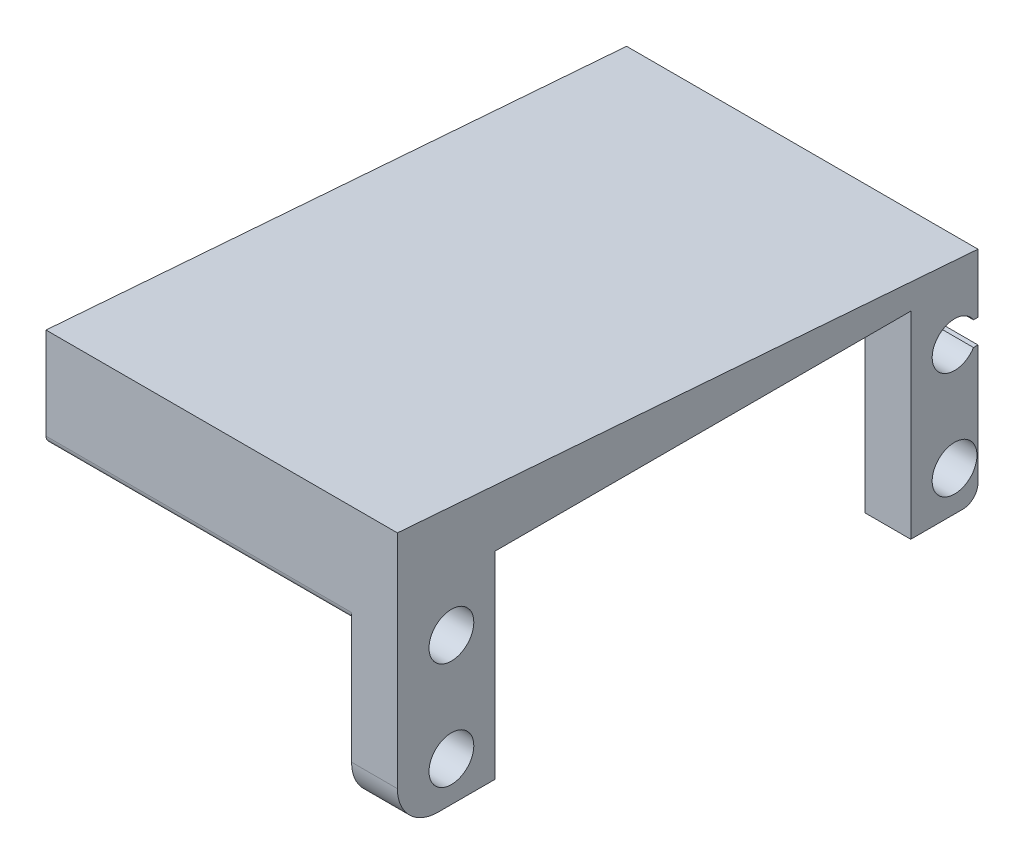
ISO-10303-21;
HEADER;
FILE_DESCRIPTION(('STEP AP214'),'2;1');
FILE_NAME('part.step','',(''),(''),'','','');
FILE_SCHEMA(('AUTOMOTIVE_DESIGN { 1 0 10303 214 1 1 1 1 }'));
ENDSEC;
DATA;
#1=APPLICATION_CONTEXT('core data for automotive mechanical design processes');
#2=APPLICATION_PROTOCOL_DEFINITION('international standard','automotive_design',2000,#1);
#3=PRODUCT_CONTEXT('',#1,'mechanical');
#4=PRODUCT('Part','Part','',(#3));
#5=PRODUCT_RELATED_PRODUCT_CATEGORY('part','',(#4));
#6=PRODUCT_DEFINITION_FORMATION('','',#4);
#7=PRODUCT_DEFINITION_CONTEXT('part definition',#1,'design');
#8=PRODUCT_DEFINITION('design','',#6,#7);
#9=PRODUCT_DEFINITION_SHAPE('','',#8);
#10=(LENGTH_UNIT() NAMED_UNIT(*) SI_UNIT(.MILLI.,.METRE.));
#11=(NAMED_UNIT(*) PLANE_ANGLE_UNIT() SI_UNIT($,.RADIAN.));
#12=(NAMED_UNIT(*) SI_UNIT($,.STERADIAN.) SOLID_ANGLE_UNIT());
#13=UNCERTAINTY_MEASURE_WITH_UNIT(LENGTH_MEASURE(1.E-05),#10,'distance_accuracy_value','');
#14=(GEOMETRIC_REPRESENTATION_CONTEXT(3) GLOBAL_UNCERTAINTY_ASSIGNED_CONTEXT((#13)) GLOBAL_UNIT_ASSIGNED_CONTEXT((#10,
#11,#12)) REPRESENTATION_CONTEXT('',''));
#15=CARTESIAN_POINT('',(0.,0.,0.));
#16=DIRECTION('',(0.,0.,1.));
#17=DIRECTION('',(1.,0.,0.));
#18=AXIS2_PLACEMENT_3D('',#15,#16,#17);
#19=CARTESIAN_POINT('',(-110.040337845467,7.82498196403375E-13,-1.90929559922423E-12));
#20=DIRECTION('',(1.,0.,0.));
#21=DIRECTION('',(0.,0.,-1.));
#22=AXIS2_PLACEMENT_3D('',#19,#20,#21);
#23=PLANE('',#22);
#24=CARTESIAN_POINT('',(-110.040337845464,42.7317666313925,-168.091431391015));
#25=DIRECTION('',(1.,0.,0.));
#26=DIRECTION('',(0.,0.,-1.));
#27=AXIS2_PLACEMENT_3D('',#24,#25,#26);
#28=CIRCLE('',#27,2.19999999999998);
#29=CARTESIAN_POINT('',(-110.040337845464,42.7317666313925,-170.291431391015));
#30=VERTEX_POINT('',#29);
#31=EDGE_CURVE('E210',#30,#30,#28,.T.);
#32=ORIENTED_EDGE('',*,*,#31,.T.);
#33=EDGE_LOOP('',(#32));
#34=FACE_BOUND('',#33,.T.);
#35=CARTESIAN_POINT('',(-110.040337845464,53.2317666313925,-168.091431391015));
#36=DIRECTION('',(1.,0.,0.));
#37=DIRECTION('',(0.,0.,-1.));
#38=AXIS2_PLACEMENT_3D('',#35,#36,#37);
#39=CIRCLE('',#38,2.19999999999998);
#40=CARTESIAN_POINT('',(-110.040337845464,53.2317666313925,-170.291431391015));
#41=VERTEX_POINT('',#40);
#42=EDGE_CURVE('E207',#41,#41,#39,.T.);
#43=ORIENTED_EDGE('',*,*,#42,.T.);
#44=EDGE_LOOP('',(#43));
#45=FACE_BOUND('',#44,.T.);
#46=DIRECTION('',(0.,-1.,0.));
#47=VECTOR('',#46,1.);
#48=CARTESIAN_POINT('',(-110.040337845465,5.74715523288253E-13,-162.791431391015));
#49=LINE('',#48,#47);
#50=CARTESIAN_POINT('',(-110.040337845464,55.5574598733274,-162.791431391015));
#51=VERTEX_POINT('',#50);
#52=CARTESIAN_POINT('',(-110.040337845464,42.8317666313926,-162.791431391015));
#53=VERTEX_POINT('',#52);
#54=EDGE_CURVE('E180',#51,#53,#49,.T.);
#55=ORIENTED_EDGE('',*,*,#54,.F.);
#56=CARTESIAN_POINT('',(-110.040337845464,55.5574598733274,-163.541431391015));
#57=DIRECTION('',(1.,0.,0.));
#58=DIRECTION('',(0.,0.,-1.));
#59=AXIS2_PLACEMENT_3D('',#56,#57,#58);
#60=CIRCLE('',#59,0.750000000000012);
#61=CARTESIAN_POINT('',(-110.040337845464,54.8074598733274,-163.541431391015));
#62=VERTEX_POINT('',#61);
#63=EDGE_CURVE('E312',#51,#62,#60,.T.);
#64=ORIENTED_EDGE('',*,*,#63,.T.);
#65=DIRECTION('',(0.,0.,1.));
#66=VECTOR('',#65,1.);
#67=CARTESIAN_POINT('',(-110.040337845467,54.8074598733274,-1.90929559922423E-12));
#68=LINE('',#67,#66);
#69=CARTESIAN_POINT('',(-110.040337845464,54.8074598733274,-165.491431391015));
#70=VERTEX_POINT('',#69);
#71=EDGE_CURVE('E352',#70,#62,#68,.T.);
#72=ORIENTED_EDGE('',*,*,#71,.F.);
#73=DIRECTION('',(0.,-1.,0.));
#74=VECTOR('',#73,1.);
#75=CARTESIAN_POINT('',(-110.040337845465,7.8249819640336E-13,-165.491431391015));
#76=LINE('',#75,#74);
#77=CARTESIAN_POINT('',(-110.040337845464,57.4317666313925,-165.491431391015));
#78=VERTEX_POINT('',#77);
#79=EDGE_CURVE('E355',#78,#70,#76,.T.);
#80=ORIENTED_EDGE('',*,*,#79,.F.);
#81=DIRECTION('',(0.,0.,1.));
#82=VECTOR('',#81,1.);
#83=CARTESIAN_POINT('',(-110.040337845467,57.4317666313925,-1.90929559922423E-12));
#84=LINE('',#83,#82);
#85=CARTESIAN_POINT('',(-110.040337845464,57.4317666313925,-172.391431391015));
#86=VERTEX_POINT('',#85);
#87=EDGE_CURVE('E256',#86,#78,#84,.T.);
#88=ORIENTED_EDGE('',*,*,#87,.F.);
#89=DIRECTION('',(0.,1.,0.));
#90=VECTOR('',#89,1.);
#91=CARTESIAN_POINT('',(-110.040337845464,7.82498196403354E-13,-172.391431391015));
#92=LINE('',#91,#90);
#93=CARTESIAN_POINT('',(-110.040337845464,38.8317666313925,-172.391431391015));
#94=VERTEX_POINT('',#93);
#95=EDGE_CURVE('E186',#94,#86,#92,.T.);
#96=ORIENTED_EDGE('',*,*,#95,.F.);
#97=DIRECTION('',(0.,0.,-1.));
#98=VECTOR('',#97,1.);
#99=CARTESIAN_POINT('',(-110.040337845467,38.8317666313927,-1.95741158293075E-12));
#100=LINE('',#99,#98);
#101=CARTESIAN_POINT('',(-110.040337845464,38.8317666313925,-166.791431391015));
#102=VERTEX_POINT('',#101);
#103=EDGE_CURVE('E184',#102,#94,#100,.T.);
#104=ORIENTED_EDGE('',*,*,#103,.F.);
#105=CARTESIAN_POINT('',(-110.040337845464,42.8317666313925,-166.791431391015));
#106=DIRECTION('',(1.,0.,0.));
#107=DIRECTION('',(0.,0.,-1.));
#108=AXIS2_PLACEMENT_3D('',#105,#106,#107);
#109=CIRCLE('',#108,4.);
#110=EDGE_CURVE('E182',#53,#102,#109,.T.);
#111=ORIENTED_EDGE('',*,*,#110,.F.);
#112=EDGE_LOOP('',(#55,#64,#72,#80,#88,#96,#104,#111));
#113=FACE_BOUND('',#112,.T.);
#114=ADVANCED_FACE('F39',(#34,#45,#113),#23,.F.);
#115=CARTESIAN_POINT('',(-105.540337845465,5.43292191238663E-13,-162.791431391015));
#116=DIRECTION('',(0.,0.,-1.));
#117=DIRECTION('',(-1.,0.,0.));
#118=AXIS2_PLACEMENT_3D('',#115,#116,#117);
#119=PLANE('',#118);
#120=DIRECTION('',(-1.,0.,0.));
#121=VECTOR('',#120,1.);
#122=CARTESIAN_POINT('',(-105.540337845464,64.5774195090353,-162.791431391015));
#123=LINE('',#122,#121);
#124=CARTESIAN_POINT('',(-105.540337845464,64.5774195090353,-162.791431391015));
#125=VERTEX_POINT('',#124);
#126=CARTESIAN_POINT('',(-140.040337845464,64.5774195090356,-162.791431391015));
#127=VERTEX_POINT('',#126);
#128=EDGE_CURVE('E179',#125,#127,#123,.T.);
#129=ORIENTED_EDGE('',*,*,#128,.T.);
#130=DIRECTION('',(0.,-1.,0.));
#131=VECTOR('',#130,1.);
#132=CARTESIAN_POINT('',(-140.040337845465,7.84204403618855E-13,-162.791431391015));
#133=LINE('',#132,#131);
#134=CARTESIAN_POINT('',(-140.040337845464,55.5574598733276,-162.791431391015));
#135=VERTEX_POINT('',#134);
#136=EDGE_CURVE('E322',#127,#135,#133,.T.);
#137=ORIENTED_EDGE('',*,*,#136,.T.);
#138=DIRECTION('',(1.,0.,0.));
#139=VECTOR('',#138,1.);
#140=CARTESIAN_POINT('',(-140.040337845464,55.5574598733276,-162.791431391015));
#141=LINE('',#140,#139);
#142=EDGE_CURVE('E307',#135,#51,#141,.T.);
#143=ORIENTED_EDGE('',*,*,#142,.T.);
#144=ORIENTED_EDGE('',*,*,#54,.T.);
#145=DIRECTION('',(-1.,0.,0.));
#146=VECTOR('',#145,1.);
#147=CARTESIAN_POINT('',(-105.540337845464,42.8317666313925,-162.791431391015));
#148=LINE('',#147,#146);
#149=CARTESIAN_POINT('',(-105.540337845464,42.8317666313925,-162.791431391015));
#150=VERTEX_POINT('',#149);
#151=EDGE_CURVE('E11',#150,#53,#148,.T.);
#152=ORIENTED_EDGE('',*,*,#151,.F.);
#153=DIRECTION('',(0.,-1.,0.));
#154=VECTOR('',#153,1.);
#155=CARTESIAN_POINT('',(-105.540337845465,5.43292191238663E-13,-162.791431391015));
#156=LINE('',#155,#154);
#157=EDGE_CURVE('E213',#125,#150,#156,.T.);
#158=ORIENTED_EDGE('',*,*,#157,.F.);
#159=EDGE_LOOP('',(#129,#137,#143,#144,#152,#158));
#160=FACE_BOUND('',#159,.T.);
#161=ADVANCED_FACE('F41',(#160),#119,.F.);
#162=CARTESIAN_POINT('',(-105.540337845464,42.8317666313925,-166.791431391015));
#163=DIRECTION('',(-1.,0.,0.));
#164=DIRECTION('',(0.,0.,1.));
#165=AXIS2_PLACEMENT_3D('',#162,#163,#164);
#166=CYLINDRICAL_SURFACE('',#165,4.);
#167=ORIENTED_EDGE('',*,*,#110,.T.);
#168=DIRECTION('',(-1.,0.,0.));
#169=VECTOR('',#168,1.);
#170=CARTESIAN_POINT('',(-105.540337845464,38.8317666313925,-166.791431391015));
#171=LINE('',#170,#169);
#172=CARTESIAN_POINT('',(-105.540337845464,38.8317666313925,-166.791431391015));
#173=VERTEX_POINT('',#172);
#174=EDGE_CURVE('E47',#173,#102,#171,.T.);
#175=ORIENTED_EDGE('',*,*,#174,.F.);
#176=CARTESIAN_POINT('',(-105.540337845464,42.8317666313925,-166.791431391015));
#177=DIRECTION('',(1.,0.,0.));
#178=DIRECTION('',(0.,0.,-1.));
#179=AXIS2_PLACEMENT_3D('',#176,#177,#178);
#180=CIRCLE('',#179,4.);
#181=EDGE_CURVE('E111',#150,#173,#180,.T.);
#182=ORIENTED_EDGE('',*,*,#181,.F.);
#183=ORIENTED_EDGE('',*,*,#151,.T.);
#184=EDGE_LOOP('',(#167,#175,#182,#183));
#185=FACE_BOUND('',#184,.T.);
#186=ADVANCED_FACE('F424',(#185),#166,.T.);
#187=CARTESIAN_POINT('',(-105.540337845467,38.8317666313927,-1.87885325280678E-12));
#188=DIRECTION('',(0.,1.,0.));
#189=DIRECTION('',(-1.,0.,0.));
#190=AXIS2_PLACEMENT_3D('',#187,#188,#189);
#191=PLANE('',#190);
#192=ORIENTED_EDGE('',*,*,#103,.T.);
#193=DIRECTION('',(-1.,0.,0.));
#194=VECTOR('',#193,1.);
#195=CARTESIAN_POINT('',(-105.540337845464,38.8317666313925,-172.391431391015));
#196=LINE('',#195,#194);
#197=CARTESIAN_POINT('',(-105.540337845464,38.8317666313925,-172.391431391015));
#198=VERTEX_POINT('',#197);
#199=EDGE_CURVE('E239',#198,#94,#196,.T.);
#200=ORIENTED_EDGE('',*,*,#199,.F.);
#201=DIRECTION('',(0.,0.,-1.));
#202=VECTOR('',#201,1.);
#203=CARTESIAN_POINT('',(-105.540337845467,38.8317666313927,-1.87885325280678E-12));
#204=LINE('',#203,#202);
#205=EDGE_CURVE('E247',#173,#198,#204,.T.);
#206=ORIENTED_EDGE('',*,*,#205,.F.);
#207=ORIENTED_EDGE('',*,*,#174,.T.);
#208=EDGE_LOOP('',(#192,#200,#206,#207));
#209=FACE_BOUND('',#208,.T.);
#210=ADVANCED_FACE('F245',(#209),#191,.F.);
#211=CARTESIAN_POINT('',(-105.540337845464,7.51074864353763E-13,-172.391431391015));
#212=DIRECTION('',(0.,0.,1.));
#213=DIRECTION('',(1.,0.,0.));
#214=AXIS2_PLACEMENT_3D('',#211,#212,#213);
#215=PLANE('',#214);
#216=ORIENTED_EDGE('',*,*,#95,.T.);
#217=DIRECTION('',(1.,0.,0.));
#218=VECTOR('',#217,1.);
#219=CARTESIAN_POINT('',(-140.040337845464,57.4317666313927,-172.391431391015));
#220=LINE('',#219,#218);
#221=CARTESIAN_POINT('',(-140.040337845464,57.4317666313927,-172.391431391015));
#222=VERTEX_POINT('',#221);
#223=EDGE_CURVE('E263',#222,#86,#220,.T.);
#224=ORIENTED_EDGE('',*,*,#223,.F.);
#225=DIRECTION('',(0.,1.,0.));
#226=VECTOR('',#225,1.);
#227=CARTESIAN_POINT('',(-140.040337845464,9.91987076733955E-13,-172.391431391015));
#228=LINE('',#227,#226);
#229=CARTESIAN_POINT('',(-140.040337845464,58.2317666313928,-172.391431391015));
#230=VERTEX_POINT('',#229);
#231=EDGE_CURVE('E338',#222,#230,#228,.T.);
#232=ORIENTED_EDGE('',*,*,#231,.T.);
#233=DIRECTION('',(-1.,0.,0.));
#234=VECTOR('',#233,1.);
#235=CARTESIAN_POINT('',(-105.540337845464,58.2317666313925,-172.391431391015));
#236=LINE('',#235,#234);
#237=CARTESIAN_POINT('',(-105.540337845464,58.2317666313925,-172.391431391015));
#238=VERTEX_POINT('',#237);
#239=EDGE_CURVE('E236',#238,#230,#236,.T.);
#240=ORIENTED_EDGE('',*,*,#239,.F.);
#241=DIRECTION('',(0.,1.,0.));
#242=VECTOR('',#241,1.);
#243=CARTESIAN_POINT('',(-105.540337845464,7.51074864353763E-13,-172.391431391015));
#244=LINE('',#243,#242);
#245=EDGE_CURVE('E372',#198,#238,#244,.T.);
#246=ORIENTED_EDGE('',*,*,#245,.F.);
#247=ORIENTED_EDGE('',*,*,#199,.T.);
#248=EDGE_LOOP('',(#216,#224,#232,#240,#246,#247));
#249=FACE_BOUND('',#248,.T.);
#250=ADVANCED_FACE('F259',(#249),#215,.F.);
#251=CARTESIAN_POINT('',(-105.540337845467,58.2317666313925,-1.82083373845094E-12));
#252=DIRECTION('',(0.,1.,0.));
#253=DIRECTION('',(-1.,0.,0.));
#254=AXIS2_PLACEMENT_3D('',#251,#252,#253);
#255=PLANE('',#254);
#256=ORIENTED_EDGE('',*,*,#239,.T.);
#257=DIRECTION('',(0.,0.,-1.));
#258=VECTOR('',#257,1.);
#259=CARTESIAN_POINT('',(-140.040337845467,58.2317666313927,-2.42311426940138E-12));
#260=LINE('',#259,#258);
#261=CARTESIAN_POINT('',(-140.040337845463,58.2317666313928,-213.191431391015));
#262=VERTEX_POINT('',#261);
#263=EDGE_CURVE('E340',#230,#262,#260,.T.);
#264=ORIENTED_EDGE('',*,*,#263,.T.);
#265=DIRECTION('',(-1.,0.,0.));
#266=VECTOR('',#265,1.);
#267=CARTESIAN_POINT('',(-105.540337845463,58.2317666313925,-213.191431391015));
#268=LINE('',#267,#266);
#269=CARTESIAN_POINT('',(-105.540337845463,58.2317666313925,-213.191431391015));
#270=VERTEX_POINT('',#269);
#271=EDGE_CURVE('E233',#270,#262,#268,.T.);
#272=ORIENTED_EDGE('',*,*,#271,.F.);
#273=DIRECTION('',(0.,0.,-1.));
#274=VECTOR('',#273,1.);
#275=CARTESIAN_POINT('',(-105.540337845467,58.2317666313925,-1.82083373845094E-12));
#276=LINE('',#275,#274);
#277=EDGE_CURVE('E374',#238,#270,#276,.T.);
#278=ORIENTED_EDGE('',*,*,#277,.F.);
#279=EDGE_LOOP('',(#256,#264,#272,#278));
#280=FACE_BOUND('',#279,.T.);
#281=ADVANCED_FACE('F411',(#280),#255,.F.);
#282=CARTESIAN_POINT('',(-105.540337845464,7.51074864353761E-13,-213.191431391015));
#283=DIRECTION('',(0.,0.,-1.));
#284=DIRECTION('',(-1.,0.,0.));
#285=AXIS2_PLACEMENT_3D('',#282,#283,#284);
#286=PLANE('',#285);
#287=ORIENTED_EDGE('',*,*,#271,.T.);
#288=DIRECTION('',(0.,-1.,0.));
#289=VECTOR('',#288,1.);
#290=CARTESIAN_POINT('',(-140.040337845464,9.91987076733953E-13,-213.191431391015));
#291=LINE('',#290,#289);
#292=CARTESIAN_POINT('',(-140.040337845463,57.4317666313927,-213.191431391015));
#293=VERTEX_POINT('',#292);
#294=EDGE_CURVE('E343',#262,#293,#291,.T.);
#295=ORIENTED_EDGE('',*,*,#294,.T.);
#296=DIRECTION('',(1.,0.,0.));
#297=VECTOR('',#296,1.);
#298=CARTESIAN_POINT('',(-140.040337845463,57.4317666313927,-213.191431391015));
#299=LINE('',#298,#297);
#300=CARTESIAN_POINT('',(-110.040337845463,57.4317666313925,-213.191431391015));
#301=VERTEX_POINT('',#300);
#302=EDGE_CURVE('E359',#293,#301,#299,.T.);
#303=ORIENTED_EDGE('',*,*,#302,.T.);
#304=DIRECTION('',(0.,-1.,0.));
#305=VECTOR('',#304,1.);
#306=CARTESIAN_POINT('',(-110.040337845464,7.82498196403351E-13,-213.191431391015));
#307=LINE('',#306,#305);
#308=CARTESIAN_POINT('',(-110.040337845463,38.8317666313925,-213.191431391015));
#309=VERTEX_POINT('',#308);
#310=EDGE_CURVE('E189',#301,#309,#307,.T.);
#311=ORIENTED_EDGE('',*,*,#310,.T.);
#312=DIRECTION('',(-1.,0.,0.));
#313=VECTOR('',#312,1.);
#314=CARTESIAN_POINT('',(-105.540337845463,38.8317666313925,-213.191431391015));
#315=LINE('',#314,#313);
#316=CARTESIAN_POINT('',(-105.540337845463,38.8317666313925,-213.191431391015));
#317=VERTEX_POINT('',#316);
#318=EDGE_CURVE('E230',#317,#309,#315,.T.);
#319=ORIENTED_EDGE('',*,*,#318,.F.);
#320=DIRECTION('',(0.,-1.,0.));
#321=VECTOR('',#320,1.);
#322=CARTESIAN_POINT('',(-105.540337845464,7.51074864353761E-13,-213.191431391015));
#323=LINE('',#322,#321);
#324=EDGE_CURVE('E376',#270,#317,#323,.T.);
#325=ORIENTED_EDGE('',*,*,#324,.F.);
#326=EDGE_LOOP('',(#287,#295,#303,#311,#319,#325));
#327=FACE_BOUND('',#326,.T.);
#328=ADVANCED_FACE('F404',(#327),#286,.F.);
#329=CARTESIAN_POINT('',(-105.540337845467,38.8317666313925,-1.83073726910026E-12));
#330=DIRECTION('',(0.,1.,0.));
#331=DIRECTION('',(-1.,0.,0.));
#332=AXIS2_PLACEMENT_3D('',#329,#330,#331);
#333=PLANE('',#332);
#334=DIRECTION('',(0.,0.,-1.));
#335=VECTOR('',#334,1.);
#336=CARTESIAN_POINT('',(-110.040337845467,38.8317666313925,-1.90929559922423E-12));
#337=LINE('',#336,#335);
#338=CARTESIAN_POINT('',(-110.040337845463,38.8317666313925,-218.291431391014));
#339=VERTEX_POINT('',#338);
#340=EDGE_CURVE('E191',#309,#339,#337,.T.);
#341=ORIENTED_EDGE('',*,*,#340,.T.);
#342=DIRECTION('',(-1.,0.,0.));
#343=VECTOR('',#342,1.);
#344=CARTESIAN_POINT('',(-105.540337845463,38.8317666313925,-218.291431391014));
#345=LINE('',#344,#343);
#346=CARTESIAN_POINT('',(-105.540337845463,38.8317666313925,-218.291431391014));
#347=VERTEX_POINT('',#346);
#348=EDGE_CURVE('E227',#347,#339,#345,.T.);
#349=ORIENTED_EDGE('',*,*,#348,.F.);
#350=DIRECTION('',(0.,0.,-1.));
#351=VECTOR('',#350,1.);
#352=CARTESIAN_POINT('',(-105.540337845467,38.8317666313925,-1.83073726910026E-12));
#353=LINE('',#352,#351);
#354=EDGE_CURVE('E378',#317,#347,#353,.T.);
#355=ORIENTED_EDGE('',*,*,#354,.F.);
#356=ORIENTED_EDGE('',*,*,#318,.T.);
#357=EDGE_LOOP('',(#341,#349,#355,#356));
#358=FACE_BOUND('',#357,.T.);
#359=ADVANCED_FACE('F523',(#358),#333,.F.);
#360=CARTESIAN_POINT('',(-105.540337845463,40.3317666313925,-218.291431391014));
#361=DIRECTION('',(-1.,0.,0.));
#362=DIRECTION('',(0.,0.,1.));
#363=AXIS2_PLACEMENT_3D('',#360,#361,#362);
#364=CYLINDRICAL_SURFACE('',#363,1.5);
#365=CARTESIAN_POINT('',(-110.040337845463,40.3317666313925,-218.291431391014));
#366=DIRECTION('',(1.,0.,0.));
#367=DIRECTION('',(0.,0.,-1.));
#368=AXIS2_PLACEMENT_3D('',#365,#366,#367);
#369=CIRCLE('',#368,1.5);
#370=CARTESIAN_POINT('',(-110.040337845463,40.3317666313925,-219.791431391014));
#371=VERTEX_POINT('',#370);
#372=EDGE_CURVE('E193',#339,#371,#369,.T.);
#373=ORIENTED_EDGE('',*,*,#372,.T.);
#374=DIRECTION('',(-1.,0.,0.));
#375=VECTOR('',#374,1.);
#376=CARTESIAN_POINT('',(-105.540337845463,40.3317666313925,-219.791431391014));
#377=LINE('',#376,#375);
#378=CARTESIAN_POINT('',(-105.540337845463,40.3317666313925,-219.791431391014));
#379=VERTEX_POINT('',#378);
#380=EDGE_CURVE('E224',#379,#371,#377,.T.);
#381=ORIENTED_EDGE('',*,*,#380,.F.);
#382=CARTESIAN_POINT('',(-105.540337845463,40.3317666313925,-218.291431391014));
#383=DIRECTION('',(1.,0.,0.));
#384=DIRECTION('',(0.,0.,-1.));
#385=AXIS2_PLACEMENT_3D('',#382,#383,#384);
#386=CIRCLE('',#385,1.5);
#387=EDGE_CURVE('E380',#347,#379,#386,.T.);
#388=ORIENTED_EDGE('',*,*,#387,.F.);
#389=ORIENTED_EDGE('',*,*,#348,.T.);
#390=EDGE_LOOP('',(#373,#381,#388,#389));
#391=FACE_BOUND('',#390,.T.);
#392=ADVANCED_FACE('F624',(#391),#364,.T.);
#393=CARTESIAN_POINT('',(-105.540337845464,-8.61606387491849E-12,-219.791431391013));
#394=DIRECTION('',(0.,0.,1.));
#395=DIRECTION('',(0.,-1.,0.));
#396=AXIS2_PLACEMENT_3D('',#393,#394,#395);
#397=PLANE('',#396);
#398=DIRECTION('',(0.,1.,0.));
#399=VECTOR('',#398,1.);
#400=CARTESIAN_POINT('',(-110.040337845464,-8.5846405428689E-12,-219.791431391013));
#401=LINE('',#400,#399);
#402=CARTESIAN_POINT('',(-110.040337845463,52.0567666313906,-219.791431391015));
#403=VERTEX_POINT('',#402);
#404=EDGE_CURVE('E195',#371,#403,#401,.T.);
#405=ORIENTED_EDGE('',*,*,#404,.T.);
#406=DIRECTION('',(-1.,0.,0.));
#407=VECTOR('',#406,1.);
#408=CARTESIAN_POINT('',(-105.540337845463,52.0567666313905,-219.791431391015));
#409=LINE('',#408,#407);
#410=CARTESIAN_POINT('',(-105.540337845463,52.0567666313905,-219.791431391015));
#411=VERTEX_POINT('',#410);
#412=EDGE_CURVE('E221',#411,#403,#409,.T.);
#413=ORIENTED_EDGE('',*,*,#412,.F.);
#414=DIRECTION('',(0.,1.,0.));
#415=VECTOR('',#414,1.);
#416=CARTESIAN_POINT('',(-105.540337845464,-8.61606387491849E-12,-219.791431391013));
#417=LINE('',#416,#415);
#418=EDGE_CURVE('E382',#379,#411,#417,.T.);
#419=ORIENTED_EDGE('',*,*,#418,.F.);
#420=ORIENTED_EDGE('',*,*,#380,.T.);
#421=EDGE_LOOP('',(#405,#413,#419,#420));
#422=FACE_BOUND('',#421,.T.);
#423=ADVANCED_FACE('F614',(#422),#397,.F.);
#424=CARTESIAN_POINT('',(-105.540337845467,52.0567666313998,-4.02404313232045E-12));
#425=DIRECTION('',(0.,-1.,0.));
#426=DIRECTION('',(0.,0.,-1.));
#427=AXIS2_PLACEMENT_3D('',#424,#425,#426);
#428=PLANE('',#427);
#429=DIRECTION('',(0.,0.,1.));
#430=VECTOR('',#429,1.);
#431=CARTESIAN_POINT('',(-110.040337845467,52.0567666313998,-4.10260146244442E-12));
#432=LINE('',#431,#430);
#433=CARTESIAN_POINT('',(-110.040337845463,52.0567666313906,-219.351370906161));
#434=VERTEX_POINT('',#433);
#435=EDGE_CURVE('E197',#403,#434,#432,.T.);
#436=ORIENTED_EDGE('',*,*,#435,.T.);
#437=DIRECTION('',(-1.,0.,0.));
#438=VECTOR('',#437,1.);
#439=CARTESIAN_POINT('',(-105.540337845463,52.0567666313906,-219.351370906161));
#440=LINE('',#439,#438);
#441=CARTESIAN_POINT('',(-105.540337845463,52.0567666313906,-219.351370906161));
#442=VERTEX_POINT('',#441);
#443=EDGE_CURVE('E218',#442,#434,#440,.T.);
#444=ORIENTED_EDGE('',*,*,#443,.F.);
#445=DIRECTION('',(0.,0.,1.));
#446=VECTOR('',#445,1.);
#447=CARTESIAN_POINT('',(-105.540337845467,52.0567666313998,-4.02404313232045E-12));
#448=LINE('',#447,#446);
#449=EDGE_CURVE('E384',#411,#442,#448,.T.);
#450=ORIENTED_EDGE('',*,*,#449,.F.);
#451=ORIENTED_EDGE('',*,*,#412,.T.);
#452=EDGE_LOOP('',(#436,#444,#450,#451));
#453=FACE_BOUND('',#452,.T.);
#454=ADVANCED_FACE('F390',(#453),#428,.F.);
#455=CARTESIAN_POINT('',(-105.540337845463,53.2317666313906,-217.491431391015));
#456=DIRECTION('',(-1.,0.,0.));
#457=DIRECTION('',(0.,0.,1.));
#458=AXIS2_PLACEMENT_3D('',#455,#456,#457);
#459=CYLINDRICAL_SURFACE('',#458,2.2);
#460=CARTESIAN_POINT('',(-110.040337845463,53.2317666313907,-217.491431391016));
#461=DIRECTION('',(1.,0.,0.));
#462=DIRECTION('',(0.,0.,-1.));
#463=AXIS2_PLACEMENT_3D('',#460,#461,#462);
#464=CIRCLE('',#463,2.2);
#465=CARTESIAN_POINT('',(-110.040337845463,54.4067666313906,-219.351370906161));
#466=VERTEX_POINT('',#465);
#467=EDGE_CURVE('E199',#434,#466,#464,.F.);
#468=ORIENTED_EDGE('',*,*,#467,.T.);
#469=DIRECTION('',(-1.,0.,0.));
#470=VECTOR('',#469,1.);
#471=CARTESIAN_POINT('',(-105.540337845463,54.4067666313906,-219.351370906161));
#472=LINE('',#471,#470);
#473=CARTESIAN_POINT('',(-105.540337845463,54.4067666313906,-219.351370906161));
#474=VERTEX_POINT('',#473);
#475=EDGE_CURVE('E160',#474,#466,#472,.T.);
#476=ORIENTED_EDGE('',*,*,#475,.F.);
#477=CARTESIAN_POINT('',(-105.540337845463,53.2317666313906,-217.491431391015));
#478=DIRECTION('',(1.,0.,0.));
#479=DIRECTION('',(0.,0.,-1.));
#480=AXIS2_PLACEMENT_3D('',#477,#478,#479);
#481=CIRCLE('',#480,2.2);
#482=EDGE_CURVE('E152',#442,#474,#481,.F.);
#483=ORIENTED_EDGE('',*,*,#482,.F.);
#484=ORIENTED_EDGE('',*,*,#443,.T.);
#485=EDGE_LOOP('',(#468,#476,#483,#484));
#486=FACE_BOUND('',#485,.T.);
#487=ADVANCED_FACE('F394',(#486),#459,.F.);
#488=CARTESIAN_POINT('',(-105.540337845467,54.4067666313998,-4.12305559721408E-12));
#489=DIRECTION('',(0.,1.,0.));
#490=DIRECTION('',(0.,0.,1.));
#491=AXIS2_PLACEMENT_3D('',#488,#489,#490);
#492=PLANE('',#491);
#493=DIRECTION('',(0.,0.,-1.));
#494=VECTOR('',#493,1.);
#495=CARTESIAN_POINT('',(-110.040337845467,54.4067666313998,-4.20161392733805E-12));
#496=LINE('',#495,#494);
#497=CARTESIAN_POINT('',(-110.040337845463,54.4067666313906,-219.791431391016));
#498=VERTEX_POINT('',#497);
#499=EDGE_CURVE('E103',#466,#498,#496,.T.);
#500=ORIENTED_EDGE('',*,*,#499,.T.);
#501=DIRECTION('',(-1.,0.,0.));
#502=VECTOR('',#501,1.);
#503=CARTESIAN_POINT('',(-105.540337845463,54.4067666313905,-219.791431391015));
#504=LINE('',#503,#502);
#505=CARTESIAN_POINT('',(-105.540337845463,54.4067666313905,-219.791431391015));
#506=VERTEX_POINT('',#505);
#507=EDGE_CURVE('E155',#506,#498,#504,.T.);
#508=ORIENTED_EDGE('',*,*,#507,.F.);
#509=DIRECTION('',(0.,0.,-1.));
#510=VECTOR('',#509,1.);
#511=CARTESIAN_POINT('',(-105.540337845467,54.4067666313998,-4.12305559721408E-12));
#512=LINE('',#511,#510);
#513=EDGE_CURVE('E145',#474,#506,#512,.T.);
#514=ORIENTED_EDGE('',*,*,#513,.F.);
#515=ORIENTED_EDGE('',*,*,#475,.T.);
#516=EDGE_LOOP('',(#500,#508,#514,#515));
#517=FACE_BOUND('',#516,.T.);
#518=ADVANCED_FACE('F156',(#517),#492,.F.);
#519=CARTESIAN_POINT('',(-105.540337845464,-8.61606387491849E-12,-219.791431391013));
#520=DIRECTION('',(0.,0.,1.));
#521=DIRECTION('',(0.,-1.,0.));
#522=AXIS2_PLACEMENT_3D('',#519,#520,#521);
#523=PLANE('',#522);
#524=DIRECTION('',(0.,1.,0.));
#525=VECTOR('',#524,1.);
#526=CARTESIAN_POINT('',(-110.040337845464,-8.5846405428689E-12,-219.791431391013));
#527=LINE('',#526,#525);
#528=CARTESIAN_POINT('',(-110.040337845463,57.4317666313925,-219.791431391016));
#529=VERTEX_POINT('',#528);
#530=EDGE_CURVE('E202',#498,#529,#527,.T.);
#531=ORIENTED_EDGE('',*,*,#530,.T.);
#532=DIRECTION('',(1.,0.,0.));
#533=VECTOR('',#532,1.);
#534=CARTESIAN_POINT('',(-140.040337845463,57.4317666313927,-219.791431391015));
#535=LINE('',#534,#533);
#536=CARTESIAN_POINT('',(-140.040337845463,57.4317666313927,-219.791431391015));
#537=VERTEX_POINT('',#536);
#538=EDGE_CURVE('E54',#537,#529,#535,.T.);
#539=ORIENTED_EDGE('',*,*,#538,.F.);
#540=DIRECTION('',(0.,1.,0.));
#541=VECTOR('',#540,1.);
#542=CARTESIAN_POINT('',(-140.040337845464,0.,-219.791431391015));
#543=LINE('',#542,#541);
#544=CARTESIAN_POINT('',(-140.040337845463,60.2004561582546,-219.791431391015));
#545=VERTEX_POINT('',#544);
#546=EDGE_CURVE('E348',#537,#545,#543,.T.);
#547=ORIENTED_EDGE('',*,*,#546,.T.);
#548=DIRECTION('',(-1.,0.,0.));
#549=VECTOR('',#548,1.);
#550=CARTESIAN_POINT('',(-105.540337845463,60.2004561582544,-219.791431391014));
#551=LINE('',#550,#549);
#552=CARTESIAN_POINT('',(-105.540337845463,60.2004561582544,-219.791431391014));
#553=VERTEX_POINT('',#552);
#554=EDGE_CURVE('E161',#553,#545,#551,.T.);
#555=ORIENTED_EDGE('',*,*,#554,.F.);
#556=DIRECTION('',(0.,1.,0.));
#557=VECTOR('',#556,1.);
#558=CARTESIAN_POINT('',(-105.540337845464,-8.61606387491849E-12,-219.791431391013));
#559=LINE('',#558,#557);
#560=EDGE_CURVE('E149',#506,#553,#559,.T.);
#561=ORIENTED_EDGE('',*,*,#560,.F.);
#562=ORIENTED_EDGE('',*,*,#507,.T.);
#563=EDGE_LOOP('',(#531,#539,#547,#555,#561,#562));
#564=FACE_BOUND('',#563,.T.);
#565=ADVANCED_FACE('F163',(#564),#523,.F.);
#566=CARTESIAN_POINT('',(-105.540337845464,53.2317666313925,-168.091431391015));
#567=DIRECTION('',(-1.,0.,0.));
#568=DIRECTION('',(0.,0.,1.));
#569=AXIS2_PLACEMENT_3D('',#566,#567,#568);
#570=CYLINDRICAL_SURFACE('',#569,2.19999999999998);
#571=CARTESIAN_POINT('',(-105.540337845464,53.2317666313925,-168.091431391015));
#572=DIRECTION('',(1.,0.,0.));
#573=DIRECTION('',(0.,0.,-1.));
#574=AXIS2_PLACEMENT_3D('',#571,#572,#573);
#575=CIRCLE('',#574,2.19999999999998);
#576=CARTESIAN_POINT('',(-105.540337845464,53.2317666313925,-170.291431391015));
#577=VERTEX_POINT('',#576);
#578=EDGE_CURVE('E173',#577,#577,#575,.T.);
#579=ORIENTED_EDGE('',*,*,#578,.T.);
#580=EDGE_LOOP('',(#579));
#581=FACE_BOUND('',#580,.T.);
#582=ORIENTED_EDGE('',*,*,#42,.F.);
#583=EDGE_LOOP('',(#582));
#584=FACE_BOUND('',#583,.T.);
#585=ADVANCED_FACE('F511',(#581,#584),#570,.F.);
#586=CARTESIAN_POINT('',(-105.540337845463,42.7317666313925,-217.491431391015));
#587=DIRECTION('',(-1.,0.,0.));
#588=DIRECTION('',(0.,0.,1.));
#589=AXIS2_PLACEMENT_3D('',#586,#587,#588);
#590=CYLINDRICAL_SURFACE('',#589,2.20000000000001);
#591=CARTESIAN_POINT('',(-105.540337845463,42.7317666313925,-217.491431391015));
#592=DIRECTION('',(1.,0.,0.));
#593=DIRECTION('',(0.,0.,-1.));
#594=AXIS2_PLACEMENT_3D('',#591,#592,#593);
#595=CIRCLE('',#594,2.20000000000001);
#596=CARTESIAN_POINT('',(-105.540337845463,42.7317666313925,-219.691431391015));
#597=VERTEX_POINT('',#596);
#598=EDGE_CURVE('E167',#597,#597,#595,.T.);
#599=ORIENTED_EDGE('',*,*,#598,.T.);
#600=EDGE_LOOP('',(#599));
#601=FACE_BOUND('',#600,.T.);
#602=CARTESIAN_POINT('',(-110.040337845463,42.7317666313925,-217.491431391015));
#603=DIRECTION('',(1.,0.,0.));
#604=DIRECTION('',(0.,0.,-1.));
#605=AXIS2_PLACEMENT_3D('',#602,#603,#604);
#606=CIRCLE('',#605,2.20000000000001);
#607=CARTESIAN_POINT('',(-110.040337845463,42.7317666313925,-219.691431391015));
#608=VERTEX_POINT('',#607);
#609=EDGE_CURVE('E204',#608,#608,#606,.T.);
#610=ORIENTED_EDGE('',*,*,#609,.F.);
#611=EDGE_LOOP('',(#610));
#612=FACE_BOUND('',#611,.T.);
#613=ADVANCED_FACE('F499',(#601,#612),#590,.F.);
#614=CARTESIAN_POINT('',(-105.540337845467,76.6261551729929,-5.88403285795699));
#615=DIRECTION('',(0.,-0.997064712375444,0.0765634334109529));
#616=DIRECTION('',(0.,-0.0765634334109529,-0.997064712375444));
#617=AXIS2_PLACEMENT_3D('',#614,#615,#616);
#618=PLANE('',#617);
#619=ORIENTED_EDGE('',*,*,#554,.T.);
#620=DIRECTION('',(0.,0.0765634334109529,0.997064712375444));
#621=VECTOR('',#620,1.);
#622=CARTESIAN_POINT('',(-140.040337845467,76.6261551729931,-5.8840328579576));
#623=LINE('',#622,#621);
#624=EDGE_CURVE('E316',#545,#127,#623,.T.);
#625=ORIENTED_EDGE('',*,*,#624,.T.);
#626=ORIENTED_EDGE('',*,*,#128,.F.);
#627=DIRECTION('',(0.,0.0765634334109529,0.997064712375444));
#628=VECTOR('',#627,1.);
#629=CARTESIAN_POINT('',(-105.540337845467,76.6261551729929,-5.88403285795699));
#630=LINE('',#629,#628);
#631=EDGE_CURVE('E63',#553,#125,#630,.T.);
#632=ORIENTED_EDGE('',*,*,#631,.F.);
#633=EDGE_LOOP('',(#619,#625,#626,#632));
#634=FACE_BOUND('',#633,.T.);
#635=ADVANCED_FACE('F449',(#634),#618,.F.);
#636=CARTESIAN_POINT('',(-105.540337845464,42.7317666313925,-168.091431391015));
#637=DIRECTION('',(-1.,0.,0.));
#638=DIRECTION('',(0.,0.,1.));
#639=AXIS2_PLACEMENT_3D('',#636,#637,#638);
#640=CYLINDRICAL_SURFACE('',#639,2.19999999999998);
#641=CARTESIAN_POINT('',(-105.540337845464,42.7317666313925,-168.091431391015));
#642=DIRECTION('',(1.,0.,0.));
#643=DIRECTION('',(0.,0.,-1.));
#644=AXIS2_PLACEMENT_3D('',#641,#642,#643);
#645=CIRCLE('',#644,2.19999999999998);
#646=CARTESIAN_POINT('',(-105.540337845464,42.7317666313925,-170.291431391015));
#647=VERTEX_POINT('',#646);
#648=EDGE_CURVE('E176',#647,#647,#645,.T.);
#649=ORIENTED_EDGE('',*,*,#648,.T.);
#650=EDGE_LOOP('',(#649));
#651=FACE_BOUND('',#650,.T.);
#652=ORIENTED_EDGE('',*,*,#31,.F.);
#653=EDGE_LOOP('',(#652));
#654=FACE_BOUND('',#653,.T.);
#655=ADVANCED_FACE('F445',(#651,#654),#640,.F.);
#656=CARTESIAN_POINT('',(-105.540337845467,7.51074864353785E-13,-1.83073726910026E-12));
#657=DIRECTION('',(1.,0.,0.));
#658=DIRECTION('',(0.,0.,-1.));
#659=AXIS2_PLACEMENT_3D('',#656,#657,#658);
#660=PLANE('',#659);
#661=ORIENTED_EDGE('',*,*,#157,.T.);
#662=ORIENTED_EDGE('',*,*,#181,.T.);
#663=ORIENTED_EDGE('',*,*,#205,.T.);
#664=ORIENTED_EDGE('',*,*,#245,.T.);
#665=ORIENTED_EDGE('',*,*,#277,.T.);
#666=ORIENTED_EDGE('',*,*,#324,.T.);
#667=ORIENTED_EDGE('',*,*,#354,.T.);
#668=ORIENTED_EDGE('',*,*,#387,.T.);
#669=ORIENTED_EDGE('',*,*,#418,.T.);
#670=ORIENTED_EDGE('',*,*,#449,.T.);
#671=ORIENTED_EDGE('',*,*,#482,.T.);
#672=ORIENTED_EDGE('',*,*,#513,.T.);
#673=ORIENTED_EDGE('',*,*,#560,.T.);
#674=ORIENTED_EDGE('',*,*,#631,.T.);
#675=EDGE_LOOP('',(#661,#662,#663,#664,#665,#666,#667,#668,#669,#670,#671,#672,#673,#674));
#676=FACE_BOUND('',#675,.T.);
#677=ORIENTED_EDGE('',*,*,#598,.F.);
#678=EDGE_LOOP('',(#677));
#679=FACE_BOUND('',#678,.T.);
#680=ORIENTED_EDGE('',*,*,#578,.F.);
#681=EDGE_LOOP('',(#680));
#682=FACE_BOUND('',#681,.T.);
#683=ORIENTED_EDGE('',*,*,#648,.F.);
#684=EDGE_LOOP('',(#683));
#685=FACE_BOUND('',#684,.T.);
#686=ADVANCED_FACE('F146',(#676,#679,#682,#685),#660,.T.);
#687=ORIENTED_EDGE('',*,*,#310,.F.);
#688=DIRECTION('',(0.,0.,-1.));
#689=VECTOR('',#688,1.);
#690=CARTESIAN_POINT('',(-110.040337845467,57.4317666313928,-1.96967634700744E-12));
#691=LINE('',#690,#689);
#692=EDGE_CURVE('E329',#301,#529,#691,.T.);
#693=ORIENTED_EDGE('',*,*,#692,.T.);
#694=ORIENTED_EDGE('',*,*,#530,.F.);
#695=ORIENTED_EDGE('',*,*,#499,.F.);
#696=ORIENTED_EDGE('',*,*,#467,.F.);
#697=ORIENTED_EDGE('',*,*,#435,.F.);
#698=ORIENTED_EDGE('',*,*,#404,.F.);
#699=ORIENTED_EDGE('',*,*,#372,.F.);
#700=ORIENTED_EDGE('',*,*,#340,.F.);
#701=EDGE_LOOP('',(#687,#693,#694,#695,#696,#697,#698,#699,#700));
#702=FACE_BOUND('',#701,.T.);
#703=ORIENTED_EDGE('',*,*,#609,.T.);
#704=EDGE_LOOP('',(#703));
#705=FACE_BOUND('',#704,.T.);
#706=ADVANCED_FACE('F397',(#702,#705),#23,.F.);
#707=CARTESIAN_POINT('',(-140.040337845467,57.431766631393,-2.49339854783392E-12));
#708=DIRECTION('',(0.,-1.,0.));
#709=DIRECTION('',(1.,0.,0.));
#710=AXIS2_PLACEMENT_3D('',#707,#708,#709);
#711=PLANE('',#710);
#712=ORIENTED_EDGE('',*,*,#692,.F.);
#713=ORIENTED_EDGE('',*,*,#302,.F.);
#714=DIRECTION('',(0.,0.,-1.));
#715=VECTOR('',#714,1.);
#716=CARTESIAN_POINT('',(-140.040337845467,57.431766631393,-2.49339854783392E-12));
#717=LINE('',#716,#715);
#718=EDGE_CURVE('E346',#293,#537,#717,.T.);
#719=ORIENTED_EDGE('',*,*,#718,.T.);
#720=ORIENTED_EDGE('',*,*,#538,.T.);
#721=EDGE_LOOP('',(#712,#713,#719,#720));
#722=FACE_BOUND('',#721,.T.);
#723=ADVANCED_FACE('F402',(#722),#711,.T.);
#724=CARTESIAN_POINT('',(-140.040337845467,57.4317666313927,-2.4330178000507E-12));
#725=DIRECTION('',(0.,1.,0.));
#726=DIRECTION('',(-1.,0.,0.));
#727=AXIS2_PLACEMENT_3D('',#724,#725,#726);
#728=PLANE('',#727);
#729=ORIENTED_EDGE('',*,*,#87,.T.);
#730=DIRECTION('',(1.,0.,0.));
#731=VECTOR('',#730,1.);
#732=CARTESIAN_POINT('',(-140.040337845464,57.4317666313927,-165.491431391015));
#733=LINE('',#732,#731);
#734=CARTESIAN_POINT('',(-140.040337845464,57.4317666313927,-165.491431391015));
#735=VERTEX_POINT('',#734);
#736=EDGE_CURVE('E362',#735,#78,#733,.T.);
#737=ORIENTED_EDGE('',*,*,#736,.F.);
#738=DIRECTION('',(0.,0.,1.));
#739=VECTOR('',#738,1.);
#740=CARTESIAN_POINT('',(-140.040337845467,57.4317666313927,-2.4330178000507E-12));
#741=LINE('',#740,#739);
#742=EDGE_CURVE('E336',#222,#735,#741,.T.);
#743=ORIENTED_EDGE('',*,*,#742,.F.);
#744=ORIENTED_EDGE('',*,*,#223,.T.);
#745=EDGE_LOOP('',(#729,#737,#743,#744));
#746=FACE_BOUND('',#745,.T.);
#747=ADVANCED_FACE('F417',(#746),#728,.F.);
#748=CARTESIAN_POINT('',(-140.040337845465,9.91987076733961E-13,-165.491431391015));
#749=DIRECTION('',(0.,0.,1.));
#750=DIRECTION('',(1.,0.,0.));
#751=AXIS2_PLACEMENT_3D('',#748,#749,#750);
#752=PLANE('',#751);
#753=ORIENTED_EDGE('',*,*,#79,.T.);
#754=DIRECTION('',(1.,0.,0.));
#755=VECTOR('',#754,1.);
#756=CARTESIAN_POINT('',(-140.040337845464,54.8074598733276,-165.491431391015));
#757=LINE('',#756,#755);
#758=CARTESIAN_POINT('',(-140.040337845464,54.8074598733276,-165.491431391015));
#759=VERTEX_POINT('',#758);
#760=EDGE_CURVE('E365',#759,#70,#757,.T.);
#761=ORIENTED_EDGE('',*,*,#760,.F.);
#762=DIRECTION('',(0.,-1.,0.));
#763=VECTOR('',#762,1.);
#764=CARTESIAN_POINT('',(-140.040337845465,9.91987076733961E-13,-165.491431391015));
#765=LINE('',#764,#763);
#766=EDGE_CURVE('E334',#735,#759,#765,.T.);
#767=ORIENTED_EDGE('',*,*,#766,.F.);
#768=ORIENTED_EDGE('',*,*,#736,.T.);
#769=EDGE_LOOP('',(#753,#761,#767,#768));
#770=FACE_BOUND('',#769,.T.);
#771=ADVANCED_FACE('F419',(#770),#752,.F.);
#772=CARTESIAN_POINT('',(-140.040337845467,54.8074598733276,-2.4330178000507E-12));
#773=DIRECTION('',(0.,1.,0.));
#774=DIRECTION('',(-1.,0.,0.));
#775=AXIS2_PLACEMENT_3D('',#772,#773,#774);
#776=PLANE('',#775);
#777=ORIENTED_EDGE('',*,*,#71,.T.);
#778=DIRECTION('',(1.,0.,0.));
#779=VECTOR('',#778,1.);
#780=CARTESIAN_POINT('',(-140.040337845464,54.8074598733276,-163.541431391015));
#781=LINE('',#780,#779);
#782=CARTESIAN_POINT('',(-140.040337845464,54.8074598733276,-163.541431391015));
#783=VERTEX_POINT('',#782);
#784=EDGE_CURVE('E315',#783,#62,#781,.T.);
#785=ORIENTED_EDGE('',*,*,#784,.F.);
#786=DIRECTION('',(0.,0.,1.));
#787=VECTOR('',#786,1.);
#788=CARTESIAN_POINT('',(-140.040337845467,54.8074598733276,-2.4330178000507E-12));
#789=LINE('',#788,#787);
#790=EDGE_CURVE('E325',#759,#783,#789,.T.);
#791=ORIENTED_EDGE('',*,*,#790,.F.);
#792=ORIENTED_EDGE('',*,*,#760,.T.);
#793=EDGE_LOOP('',(#777,#785,#791,#792));
#794=FACE_BOUND('',#793,.T.);
#795=ADVANCED_FACE('F422',(#794),#776,.F.);
#796=CARTESIAN_POINT('',(-140.040337845464,55.5574598733276,-163.541431391015));
#797=DIRECTION('',(1.,0.,0.));
#798=DIRECTION('',(0.,0.,-1.));
#799=AXIS2_PLACEMENT_3D('',#796,#797,#798);
#800=CYLINDRICAL_SURFACE('',#799,0.750000000000012);
#801=ORIENTED_EDGE('',*,*,#63,.F.);
#802=ORIENTED_EDGE('',*,*,#142,.F.);
#803=CARTESIAN_POINT('',(-140.040337845464,55.5574598733276,-163.541431391015));
#804=DIRECTION('',(1.,0.,0.));
#805=DIRECTION('',(0.,0.,-1.));
#806=AXIS2_PLACEMENT_3D('',#803,#804,#805);
#807=CIRCLE('',#806,0.750000000000012);
#808=EDGE_CURVE('E310',#135,#783,#807,.T.);
#809=ORIENTED_EDGE('',*,*,#808,.T.);
#810=ORIENTED_EDGE('',*,*,#784,.T.);
#811=EDGE_LOOP('',(#801,#802,#809,#810));
#812=FACE_BOUND('',#811,.T.);
#813=ADVANCED_FACE('F309',(#812),#800,.T.);
#814=CARTESIAN_POINT('',(-140.040337845467,9.91987076733976E-13,-2.43301780005071E-12));
#815=DIRECTION('',(1.,0.,0.));
#816=DIRECTION('',(0.,0.,-1.));
#817=AXIS2_PLACEMENT_3D('',#814,#815,#816);
#818=PLANE('',#817);
#819=ORIENTED_EDGE('',*,*,#136,.F.);
#820=ORIENTED_EDGE('',*,*,#624,.F.);
#821=ORIENTED_EDGE('',*,*,#546,.F.);
#822=ORIENTED_EDGE('',*,*,#718,.F.);
#823=ORIENTED_EDGE('',*,*,#294,.F.);
#824=ORIENTED_EDGE('',*,*,#263,.F.);
#825=ORIENTED_EDGE('',*,*,#231,.F.);
#826=ORIENTED_EDGE('',*,*,#742,.T.);
#827=ORIENTED_EDGE('',*,*,#766,.T.);
#828=ORIENTED_EDGE('',*,*,#790,.T.);
#829=ORIENTED_EDGE('',*,*,#808,.F.);
#830=EDGE_LOOP('',(#819,#820,#821,#822,#823,#824,#825,#826,#827,#828,#829));
#831=FACE_BOUND('',#830,.T.);
#832=ADVANCED_FACE('F320',(#831),#818,.F.);
#833=CLOSED_SHELL('',(#114,#161,#186,#210,#250,#281,#328,#359,#392,#423,#454,#487,#518,#565,
#585,#613,#635,#655,#686,#706,#723,#747,#771,#795,#813,#832));
#834=MANIFOLD_SOLID_BREP('B2',#833);
#835=ADVANCED_BREP_SHAPE_REPRESENTATION('',(#18,#834),#14);
#836=SHAPE_DEFINITION_REPRESENTATION(#9,#835);
ENDSEC;
END-ISO-10303-21;
